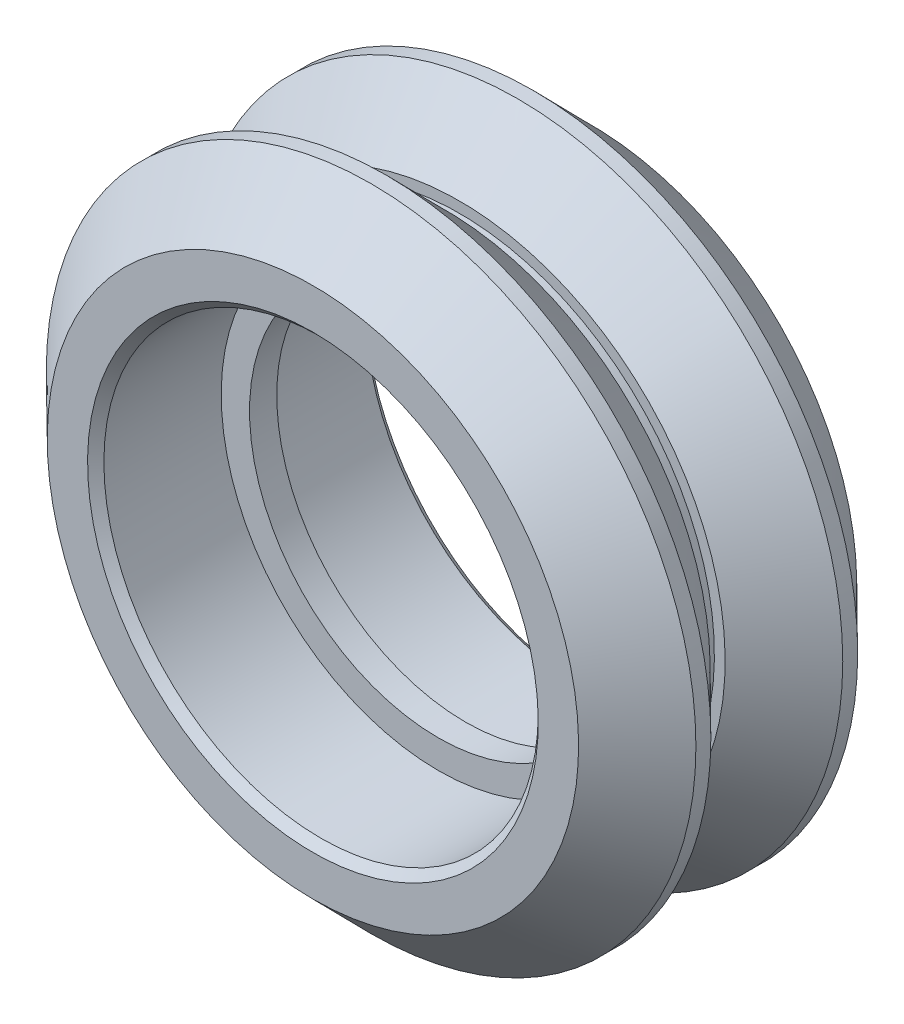
ISO-10303-21;
HEADER;
FILE_DESCRIPTION(('STEP AP214'),'2;1');
FILE_NAME('part.step','',(''),(''),'','','');
FILE_SCHEMA(('AUTOMOTIVE_DESIGN { 1 0 10303 214 1 1 1 1 }'));
ENDSEC;
DATA;
#1=APPLICATION_CONTEXT('core data for automotive mechanical design processes');
#2=APPLICATION_PROTOCOL_DEFINITION('international standard','automotive_design',2000,#1);
#3=PRODUCT_CONTEXT('',#1,'mechanical');
#4=PRODUCT('Part','Part','',(#3));
#5=PRODUCT_RELATED_PRODUCT_CATEGORY('part','',(#4));
#6=PRODUCT_DEFINITION_FORMATION('','',#4);
#7=PRODUCT_DEFINITION_CONTEXT('part definition',#1,'design');
#8=PRODUCT_DEFINITION('design','',#6,#7);
#9=PRODUCT_DEFINITION_SHAPE('','',#8);
#10=(LENGTH_UNIT() NAMED_UNIT(*) SI_UNIT(.MILLI.,.METRE.));
#11=(NAMED_UNIT(*) PLANE_ANGLE_UNIT() SI_UNIT($,.RADIAN.));
#12=(NAMED_UNIT(*) SI_UNIT($,.STERADIAN.) SOLID_ANGLE_UNIT());
#13=UNCERTAINTY_MEASURE_WITH_UNIT(LENGTH_MEASURE(1.E-05),#10,'distance_accuracy_value','');
#14=(GEOMETRIC_REPRESENTATION_CONTEXT(3) GLOBAL_UNCERTAINTY_ASSIGNED_CONTEXT((#13)) GLOBAL_UNIT_ASSIGNED_CONTEXT((#10,
#11,#12)) REPRESENTATION_CONTEXT('',''));
#15=CARTESIAN_POINT('',(0.,0.,0.));
#16=DIRECTION('',(0.,0.,1.));
#17=DIRECTION('',(1.,0.,0.));
#18=AXIS2_PLACEMENT_3D('',#15,#16,#17);
#19=CARTESIAN_POINT('',(0.,0.,5.115));
#20=DIRECTION('',(0.,0.,1.));
#21=DIRECTION('',(0.,-1.,0.));
#22=AXIS2_PLACEMENT_3D('',#19,#20,#21);
#23=CYLINDRICAL_SURFACE('',#22,7.987);
#24=CARTESIAN_POINT('',(0.,0.,4.815));
#25=DIRECTION('',(0.,0.,-1.));
#26=DIRECTION('',(0.,1.,0.));
#27=AXIS2_PLACEMENT_3D('',#24,#25,#26);
#28=CIRCLE('',#27,7.987);
#29=CARTESIAN_POINT('',(0.,7.987,4.815));
#30=VERTEX_POINT('',#29);
#31=EDGE_CURVE('E55',#30,#30,#28,.F.);
#32=ORIENTED_EDGE('',*,*,#31,.T.);
#33=EDGE_LOOP('',(#32));
#34=FACE_BOUND('',#33,.T.);
#35=CARTESIAN_POINT('',(0.,0.,0.499999999999998));
#36=DIRECTION('',(0.,0.,1.));
#37=DIRECTION('',(0.,-1.,0.));
#38=AXIS2_PLACEMENT_3D('',#35,#36,#37);
#39=CIRCLE('',#38,7.987);
#40=CARTESIAN_POINT('',(0.,-7.987,0.499999999999996));
#41=VERTEX_POINT('',#40);
#42=EDGE_CURVE('E107',#41,#41,#39,.T.);
#43=ORIENTED_EDGE('',*,*,#42,.F.);
#44=EDGE_LOOP('',(#43));
#45=FACE_BOUND('',#44,.T.);
#46=ADVANCED_FACE('F37',(#34,#45),#23,.F.);
#47=CARTESIAN_POINT('',(0.,9.77,5.115));
#48=DIRECTION('',(0.,0.,-1.));
#49=DIRECTION('',(0.,1.,0.));
#50=AXIS2_PLACEMENT_3D('',#47,#48,#49);
#51=PLANE('',#50);
#52=CARTESIAN_POINT('',(0.,0.,5.115));
#53=DIRECTION('',(0.,0.,-1.));
#54=DIRECTION('',(0.,1.,0.));
#55=AXIS2_PLACEMENT_3D('',#52,#53,#54);
#56=CIRCLE('',#55,8.287);
#57=CARTESIAN_POINT('',(0.,8.287,5.115));
#58=VERTEX_POINT('',#57);
#59=EDGE_CURVE('E51',#58,#58,#56,.T.);
#60=ORIENTED_EDGE('',*,*,#59,.T.);
#61=EDGE_LOOP('',(#60));
#62=FACE_BOUND('',#61,.T.);
#63=CARTESIAN_POINT('',(0.,0.,5.115));
#64=DIRECTION('',(0.,0.,1.));
#65=DIRECTION('',(0.,-1.,0.));
#66=AXIS2_PLACEMENT_3D('',#63,#64,#65);
#67=CIRCLE('',#66,9.77);
#68=CARTESIAN_POINT('',(0.,-9.77,5.115));
#69=VERTEX_POINT('',#68);
#70=EDGE_CURVE('E60',#69,#69,#67,.T.);
#71=ORIENTED_EDGE('',*,*,#70,.T.);
#72=EDGE_LOOP('',(#71));
#73=FACE_BOUND('',#72,.T.);
#74=ADVANCED_FACE('F114',(#62,#73),#51,.F.);
#75=CARTESIAN_POINT('',(0.,0.,2.975));
#76=DIRECTION('',(0.,0.,-1.));
#77=DIRECTION('',(0.,1.,0.));
#78=AXIS2_PLACEMENT_3D('',#75,#76,#77);
#79=CONICAL_SURFACE('',#78,11.945,0.79350922537995);
#80=ORIENTED_EDGE('',*,*,#70,.F.);
#81=EDGE_LOOP('',(#80));
#82=FACE_BOUND('',#81,.T.);
#83=CARTESIAN_POINT('',(0.,0.,2.975));
#84=DIRECTION('',(0.,0.,1.));
#85=DIRECTION('',(0.,-1.,0.));
#86=AXIS2_PLACEMENT_3D('',#83,#84,#85);
#87=CIRCLE('',#86,11.945);
#88=CARTESIAN_POINT('',(0.,-11.945,2.975));
#89=VERTEX_POINT('',#88);
#90=EDGE_CURVE('E63',#89,#89,#87,.T.);
#91=ORIENTED_EDGE('',*,*,#90,.T.);
#92=EDGE_LOOP('',(#91));
#93=FACE_BOUND('',#92,.T.);
#94=ADVANCED_FACE('F120',(#82,#93),#79,.T.);
#95=CARTESIAN_POINT('',(0.,0.,5.115));
#96=DIRECTION('',(0.,0.,1.));
#97=DIRECTION('',(0.,-1.,0.));
#98=AXIS2_PLACEMENT_3D('',#95,#96,#97);
#99=CYLINDRICAL_SURFACE('',#98,11.945);
#100=ORIENTED_EDGE('',*,*,#90,.F.);
#101=EDGE_LOOP('',(#100));
#102=FACE_BOUND('',#101,.T.);
#103=CARTESIAN_POINT('',(0.,0.,2.425));
#104=DIRECTION('',(0.,0.,1.));
#105=DIRECTION('',(0.,-1.,0.));
#106=AXIS2_PLACEMENT_3D('',#103,#104,#105);
#107=CIRCLE('',#106,11.945);
#108=CARTESIAN_POINT('',(0.,-11.945,2.425));
#109=VERTEX_POINT('',#108);
#110=EDGE_CURVE('E67',#109,#109,#107,.T.);
#111=ORIENTED_EDGE('',*,*,#110,.T.);
#112=EDGE_LOOP('',(#111));
#113=FACE_BOUND('',#112,.T.);
#114=ADVANCED_FACE('F143',(#102,#113),#99,.T.);
#115=CARTESIAN_POINT('',(0.,0.,0.274999999999998));
#116=DIRECTION('',(0.,0.,1.));
#117=DIRECTION('',(0.,-1.,0.));
#118=AXIS2_PLACEMENT_3D('',#115,#116,#117);
#119=CONICAL_SURFACE('',#118,9.77,0.791178445841111);
#120=ORIENTED_EDGE('',*,*,#110,.F.);
#121=EDGE_LOOP('',(#120));
#122=FACE_BOUND('',#121,.T.);
#123=CARTESIAN_POINT('',(0.,0.,0.274999999999998));
#124=DIRECTION('',(0.,0.,1.));
#125=DIRECTION('',(0.,-1.,0.));
#126=AXIS2_PLACEMENT_3D('',#123,#124,#125);
#127=CIRCLE('',#126,9.77);
#128=CARTESIAN_POINT('',(0.,-9.77,0.274999999999997));
#129=VERTEX_POINT('',#128);
#130=EDGE_CURVE('E71',#129,#129,#127,.T.);
#131=ORIENTED_EDGE('',*,*,#130,.T.);
#132=EDGE_LOOP('',(#131));
#133=FACE_BOUND('',#132,.T.);
#134=ADVANCED_FACE('F148',(#122,#133),#119,.T.);
#135=CARTESIAN_POINT('',(0.,9.77,0.275));
#136=DIRECTION('',(0.,0.,1.));
#137=DIRECTION('',(0.,-1.,0.));
#138=AXIS2_PLACEMENT_3D('',#135,#136,#137);
#139=PLANE('',#138);
#140=ORIENTED_EDGE('',*,*,#130,.F.);
#141=EDGE_LOOP('',(#140));
#142=FACE_BOUND('',#141,.T.);
#143=CARTESIAN_POINT('',(0.,0.,0.274999999999998));
#144=DIRECTION('',(0.,0.,1.));
#145=DIRECTION('',(0.,-1.,0.));
#146=AXIS2_PLACEMENT_3D('',#143,#144,#145);
#147=CIRCLE('',#146,9.375);
#148=CARTESIAN_POINT('',(0.,-9.375,0.274999999999997));
#149=VERTEX_POINT('',#148);
#150=EDGE_CURVE('E75',#149,#149,#147,.T.);
#151=ORIENTED_EDGE('',*,*,#150,.T.);
#152=EDGE_LOOP('',(#151));
#153=FACE_BOUND('',#152,.T.);
#154=ADVANCED_FACE('F154',(#142,#153),#139,.F.);
#155=CARTESIAN_POINT('',(0.,0.,5.115));
#156=DIRECTION('',(0.,0.,1.));
#157=DIRECTION('',(0.,-1.,0.));
#158=AXIS2_PLACEMENT_3D('',#155,#156,#157);
#159=CYLINDRICAL_SURFACE('',#158,9.375);
#160=ORIENTED_EDGE('',*,*,#150,.F.);
#161=EDGE_LOOP('',(#160));
#162=FACE_BOUND('',#161,.T.);
#163=CARTESIAN_POINT('',(0.,0.,-0.275000000000002));
#164=DIRECTION('',(0.,0.,1.));
#165=DIRECTION('',(0.,-1.,0.));
#166=AXIS2_PLACEMENT_3D('',#163,#164,#165);
#167=CIRCLE('',#166,9.375);
#168=CARTESIAN_POINT('',(0.,-9.375,-0.275000000000004));
#169=VERTEX_POINT('',#168);
#170=EDGE_CURVE('E78',#169,#169,#167,.T.);
#171=ORIENTED_EDGE('',*,*,#170,.T.);
#172=EDGE_LOOP('',(#171));
#173=FACE_BOUND('',#172,.T.);
#174=ADVANCED_FACE('F160',(#162,#173),#159,.T.);
#175=CARTESIAN_POINT('',(0.,9.77,-0.275));
#176=DIRECTION('',(0.,0.,-1.));
#177=DIRECTION('',(0.,1.,0.));
#178=AXIS2_PLACEMENT_3D('',#175,#176,#177);
#179=PLANE('',#178);
#180=ORIENTED_EDGE('',*,*,#170,.F.);
#181=EDGE_LOOP('',(#180));
#182=FACE_BOUND('',#181,.T.);
#183=CARTESIAN_POINT('',(0.,0.,-0.275000000000002));
#184=DIRECTION('',(0.,0.,1.));
#185=DIRECTION('',(0.,-1.,0.));
#186=AXIS2_PLACEMENT_3D('',#183,#184,#185);
#187=CIRCLE('',#186,9.77);
#188=CARTESIAN_POINT('',(0.,-9.77,-0.275000000000004));
#189=VERTEX_POINT('',#188);
#190=EDGE_CURVE('E82',#189,#189,#187,.T.);
#191=ORIENTED_EDGE('',*,*,#190,.T.);
#192=EDGE_LOOP('',(#191));
#193=FACE_BOUND('',#192,.T.);
#194=ADVANCED_FACE('F166',(#182,#193),#179,.F.);
#195=CARTESIAN_POINT('',(0.,0.,-2.425));
#196=DIRECTION('',(0.,0.,-1.));
#197=DIRECTION('',(0.,1.,0.));
#198=AXIS2_PLACEMENT_3D('',#195,#196,#197);
#199=CONICAL_SURFACE('',#198,11.945,0.791178445841111);
#200=ORIENTED_EDGE('',*,*,#190,.F.);
#201=EDGE_LOOP('',(#200));
#202=FACE_BOUND('',#201,.T.);
#203=CARTESIAN_POINT('',(0.,0.,-2.425));
#204=DIRECTION('',(0.,0.,1.));
#205=DIRECTION('',(0.,-1.,0.));
#206=AXIS2_PLACEMENT_3D('',#203,#204,#205);
#207=CIRCLE('',#206,11.945);
#208=CARTESIAN_POINT('',(0.,-11.945,-2.425));
#209=VERTEX_POINT('',#208);
#210=EDGE_CURVE('E86',#209,#209,#207,.T.);
#211=ORIENTED_EDGE('',*,*,#210,.T.);
#212=EDGE_LOOP('',(#211));
#213=FACE_BOUND('',#212,.T.);
#214=ADVANCED_FACE('F172',(#202,#213),#199,.T.);
#215=CARTESIAN_POINT('',(0.,0.,5.115));
#216=DIRECTION('',(0.,0.,1.));
#217=DIRECTION('',(0.,-1.,0.));
#218=AXIS2_PLACEMENT_3D('',#215,#216,#217);
#219=CYLINDRICAL_SURFACE('',#218,11.945);
#220=ORIENTED_EDGE('',*,*,#210,.F.);
#221=EDGE_LOOP('',(#220));
#222=FACE_BOUND('',#221,.T.);
#223=CARTESIAN_POINT('',(0.,0.,-2.975));
#224=DIRECTION('',(0.,0.,1.));
#225=DIRECTION('',(0.,-1.,0.));
#226=AXIS2_PLACEMENT_3D('',#223,#224,#225);
#227=CIRCLE('',#226,11.945);
#228=CARTESIAN_POINT('',(0.,-11.945,-2.975));
#229=VERTEX_POINT('',#228);
#230=EDGE_CURVE('E90',#229,#229,#227,.T.);
#231=ORIENTED_EDGE('',*,*,#230,.T.);
#232=EDGE_LOOP('',(#231));
#233=FACE_BOUND('',#232,.T.);
#234=ADVANCED_FACE('F178',(#222,#233),#219,.T.);
#235=CARTESIAN_POINT('',(0.,0.,-5.115));
#236=DIRECTION('',(0.,0.,1.));
#237=DIRECTION('',(0.,-1.,0.));
#238=AXIS2_PLACEMENT_3D('',#235,#236,#237);
#239=CONICAL_SURFACE('',#238,9.77,0.79350922537995);
#240=ORIENTED_EDGE('',*,*,#230,.F.);
#241=EDGE_LOOP('',(#240));
#242=FACE_BOUND('',#241,.T.);
#243=CARTESIAN_POINT('',(0.,0.,-5.115));
#244=DIRECTION('',(0.,0.,1.));
#245=DIRECTION('',(0.,-1.,0.));
#246=AXIS2_PLACEMENT_3D('',#243,#244,#245);
#247=CIRCLE('',#246,9.77);
#248=CARTESIAN_POINT('',(0.,-9.77,-5.115));
#249=VERTEX_POINT('',#248);
#250=EDGE_CURVE('E94',#249,#249,#247,.T.);
#251=ORIENTED_EDGE('',*,*,#250,.T.);
#252=EDGE_LOOP('',(#251));
#253=FACE_BOUND('',#252,.T.);
#254=ADVANCED_FACE('F184',(#242,#253),#239,.T.);
#255=CARTESIAN_POINT('',(0.,9.77,-5.115));
#256=DIRECTION('',(0.,0.,1.));
#257=DIRECTION('',(0.,-1.,0.));
#258=AXIS2_PLACEMENT_3D('',#255,#256,#257);
#259=PLANE('',#258);
#260=CARTESIAN_POINT('',(0.,0.,-5.115));
#261=DIRECTION('',(0.,0.,1.));
#262=DIRECTION('',(0.,-1.,0.));
#263=AXIS2_PLACEMENT_3D('',#260,#261,#262);
#264=CIRCLE('',#263,8.28700000000001);
#265=CARTESIAN_POINT('',(0.,-8.287,-5.115));
#266=VERTEX_POINT('',#265);
#267=EDGE_CURVE('E45',#266,#266,#264,.T.);
#268=ORIENTED_EDGE('',*,*,#267,.T.);
#269=EDGE_LOOP('',(#268));
#270=FACE_BOUND('',#269,.T.);
#271=ORIENTED_EDGE('',*,*,#250,.F.);
#272=EDGE_LOOP('',(#271));
#273=FACE_BOUND('',#272,.T.);
#274=ADVANCED_FACE('F190',(#270,#273),#259,.F.);
#275=CARTESIAN_POINT('',(0.,0.,5.115));
#276=DIRECTION('',(0.,0.,1.));
#277=DIRECTION('',(0.,-1.,0.));
#278=AXIS2_PLACEMENT_3D('',#275,#276,#277);
#279=CYLINDRICAL_SURFACE('',#278,7.987);
#280=CARTESIAN_POINT('',(0.,0.,-4.815));
#281=DIRECTION('',(0.,0.,1.));
#282=DIRECTION('',(0.,-1.,0.));
#283=AXIS2_PLACEMENT_3D('',#280,#281,#282);
#284=CIRCLE('',#283,7.987);
#285=CARTESIAN_POINT('',(0.,-7.987,-4.815));
#286=VERTEX_POINT('',#285);
#287=EDGE_CURVE('E10',#286,#286,#284,.F.);
#288=ORIENTED_EDGE('',*,*,#287,.T.);
#289=EDGE_LOOP('',(#288));
#290=FACE_BOUND('',#289,.T.);
#291=CARTESIAN_POINT('',(0.,0.,-0.500000000000001));
#292=DIRECTION('',(0.,0.,1.));
#293=DIRECTION('',(0.,-1.,0.));
#294=AXIS2_PLACEMENT_3D('',#291,#292,#293);
#295=CIRCLE('',#294,7.987);
#296=CARTESIAN_POINT('',(0.,-7.987,-0.500000000000003));
#297=VERTEX_POINT('',#296);
#298=EDGE_CURVE('E98',#297,#297,#295,.T.);
#299=ORIENTED_EDGE('',*,*,#298,.T.);
#300=EDGE_LOOP('',(#299));
#301=FACE_BOUND('',#300,.T.);
#302=ADVANCED_FACE('F195',(#290,#301),#279,.F.);
#303=CARTESIAN_POINT('',(0.,7.987,-0.5));
#304=DIRECTION('',(0.,0.,1.));
#305=DIRECTION('',(0.,-1.,0.));
#306=AXIS2_PLACEMENT_3D('',#303,#304,#305);
#307=PLANE('',#306);
#308=ORIENTED_EDGE('',*,*,#298,.F.);
#309=EDGE_LOOP('',(#308));
#310=FACE_BOUND('',#309,.T.);
#311=CARTESIAN_POINT('',(0.,0.,-0.500000000000002));
#312=DIRECTION('',(0.,0.,1.));
#313=DIRECTION('',(0.,-1.,0.));
#314=AXIS2_PLACEMENT_3D('',#311,#312,#313);
#315=CIRCLE('',#314,6.945);
#316=CARTESIAN_POINT('',(0.,-6.945,-0.500000000000003));
#317=VERTEX_POINT('',#316);
#318=EDGE_CURVE('E101',#317,#317,#315,.T.);
#319=ORIENTED_EDGE('',*,*,#318,.T.);
#320=EDGE_LOOP('',(#319));
#321=FACE_BOUND('',#320,.T.);
#322=ADVANCED_FACE('F200',(#310,#321),#307,.F.);
#323=CARTESIAN_POINT('',(0.,0.,5.115));
#324=DIRECTION('',(0.,0.,1.));
#325=DIRECTION('',(0.,-1.,0.));
#326=AXIS2_PLACEMENT_3D('',#323,#324,#325);
#327=CYLINDRICAL_SURFACE('',#326,6.945);
#328=ORIENTED_EDGE('',*,*,#318,.F.);
#329=EDGE_LOOP('',(#328));
#330=FACE_BOUND('',#329,.T.);
#331=CARTESIAN_POINT('',(0.,0.,0.499999999999999));
#332=DIRECTION('',(0.,0.,1.));
#333=DIRECTION('',(0.,-1.,0.));
#334=AXIS2_PLACEMENT_3D('',#331,#332,#333);
#335=CIRCLE('',#334,6.945);
#336=CARTESIAN_POINT('',(0.,-6.945,0.499999999999997));
#337=VERTEX_POINT('',#336);
#338=EDGE_CURVE('E104',#337,#337,#335,.T.);
#339=ORIENTED_EDGE('',*,*,#338,.T.);
#340=EDGE_LOOP('',(#339));
#341=FACE_BOUND('',#340,.T.);
#342=ADVANCED_FACE('F132',(#330,#341),#327,.F.);
#343=CARTESIAN_POINT('',(0.,7.987,0.5));
#344=DIRECTION('',(0.,0.,-1.));
#345=DIRECTION('',(0.,1.,0.));
#346=AXIS2_PLACEMENT_3D('',#343,#344,#345);
#347=PLANE('',#346);
#348=ORIENTED_EDGE('',*,*,#338,.F.);
#349=EDGE_LOOP('',(#348));
#350=FACE_BOUND('',#349,.T.);
#351=ORIENTED_EDGE('',*,*,#42,.T.);
#352=EDGE_LOOP('',(#351));
#353=FACE_BOUND('',#352,.T.);
#354=ADVANCED_FACE('F111',(#350,#353),#347,.F.);
#355=CARTESIAN_POINT('',(0.,0.,4.815));
#356=DIRECTION('',(0.,0.,1.));
#357=DIRECTION('',(0.,-1.,0.));
#358=AXIS2_PLACEMENT_3D('',#355,#356,#357);
#359=CONICAL_SURFACE('',#358,7.987,0.78539816339746);
#360=ORIENTED_EDGE('',*,*,#59,.F.);
#361=EDGE_LOOP('',(#360));
#362=FACE_BOUND('',#361,.T.);
#363=ORIENTED_EDGE('',*,*,#31,.F.);
#364=EDGE_LOOP('',(#363));
#365=FACE_BOUND('',#364,.T.);
#366=ADVANCED_FACE('F124',(#362,#365),#359,.F.);
#367=CARTESIAN_POINT('',(0.,0.,-5.115));
#368=DIRECTION('',(0.,0.,-1.));
#369=DIRECTION('',(0.,1.,0.));
#370=AXIS2_PLACEMENT_3D('',#367,#368,#369);
#371=CONICAL_SURFACE('',#370,8.28700000000001,0.785398163397448);
#372=ORIENTED_EDGE('',*,*,#287,.F.);
#373=EDGE_LOOP('',(#372));
#374=FACE_BOUND('',#373,.T.);
#375=ORIENTED_EDGE('',*,*,#267,.F.);
#376=EDGE_LOOP('',(#375));
#377=FACE_BOUND('',#376,.T.);
#378=ADVANCED_FACE('F39',(#374,#377),#371,.F.);
#379=CLOSED_SHELL('',(#46,#74,#94,#114,#134,#154,#174,#194,#214,#234,#254,#274,#302,#322,#342,
#354,#366,#378));
#380=MANIFOLD_SOLID_BREP('B2',#379);
#381=ADVANCED_BREP_SHAPE_REPRESENTATION('',(#18,#380),#14);
#382=SHAPE_DEFINITION_REPRESENTATION(#9,#381);
ENDSEC;
END-ISO-10303-21;
